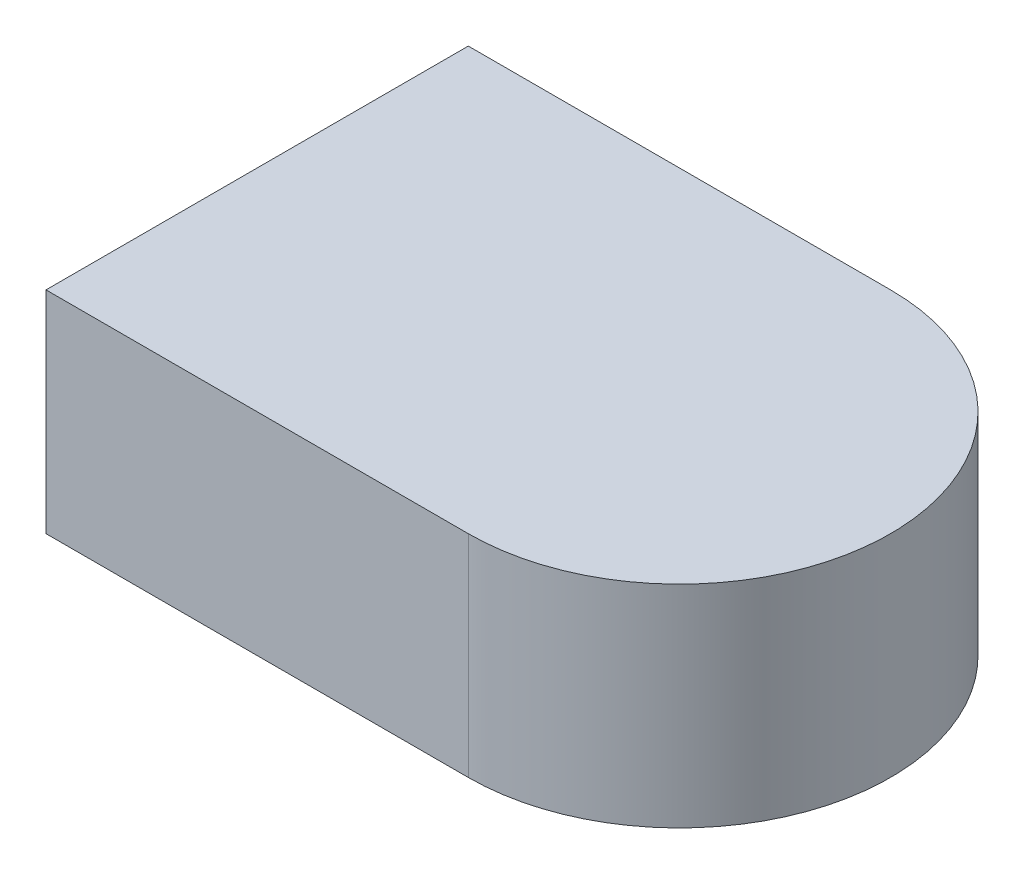
ISO-10303-21;
HEADER;
FILE_DESCRIPTION(('STEP AP214'),'2;1');
FILE_NAME('part.step','',(''),(''),'','','');
FILE_SCHEMA(('AUTOMOTIVE_DESIGN { 1 0 10303 214 1 1 1 1 }'));
ENDSEC;
DATA;
#1=APPLICATION_CONTEXT('core data for automotive mechanical design processes');
#2=APPLICATION_PROTOCOL_DEFINITION('international standard','automotive_design',2000,#1);
#3=PRODUCT_CONTEXT('',#1,'mechanical');
#4=PRODUCT('Part','Part','',(#3));
#5=PRODUCT_RELATED_PRODUCT_CATEGORY('part','',(#4));
#6=PRODUCT_DEFINITION_FORMATION('','',#4);
#7=PRODUCT_DEFINITION_CONTEXT('part definition',#1,'design');
#8=PRODUCT_DEFINITION('design','',#6,#7);
#9=PRODUCT_DEFINITION_SHAPE('','',#8);
#10=(LENGTH_UNIT() NAMED_UNIT(*) SI_UNIT(.MILLI.,.METRE.));
#11=(NAMED_UNIT(*) PLANE_ANGLE_UNIT() SI_UNIT($,.RADIAN.));
#12=(NAMED_UNIT(*) SI_UNIT($,.STERADIAN.) SOLID_ANGLE_UNIT());
#13=UNCERTAINTY_MEASURE_WITH_UNIT(LENGTH_MEASURE(1.E-05),#10,'distance_accuracy_value','');
#14=(GEOMETRIC_REPRESENTATION_CONTEXT(3) GLOBAL_UNCERTAINTY_ASSIGNED_CONTEXT((#13)) GLOBAL_UNIT_ASSIGNED_CONTEXT((#10,
#11,#12)) REPRESENTATION_CONTEXT('',''));
#15=CARTESIAN_POINT('',(0.,0.,0.));
#16=DIRECTION('',(0.,0.,1.));
#17=DIRECTION('',(1.,0.,0.));
#18=AXIS2_PLACEMENT_3D('',#15,#16,#17);
#19=CARTESIAN_POINT('',(0.,0.,0.));
#20=DIRECTION('',(0.,-1.,0.));
#21=DIRECTION('',(-1.,0.,0.));
#22=AXIS2_PLACEMENT_3D('',#19,#20,#21);
#23=PLANE('',#22);
#24=CARTESIAN_POINT('',(-1.05,0.,0.2));
#25=DIRECTION('',(0.,-1.,0.));
#26=DIRECTION('',(0.,0.,-1.));
#27=AXIS2_PLACEMENT_3D('',#24,#25,#26);
#28=CIRCLE('',#27,0.1);
#29=CARTESIAN_POINT('',(-1.05,0.,0.1));
#30=VERTEX_POINT('',#29);
#31=CARTESIAN_POINT('',(-1.05,0.,0.3));
#32=VERTEX_POINT('',#31);
#33=EDGE_CURVE('E11',#30,#32,#28,.T.);
#34=ORIENTED_EDGE('',*,*,#33,.T.);
#35=DIRECTION('',(-1.,0.,0.));
#36=VECTOR('',#35,1.);
#37=CARTESIAN_POINT('',(-1.05,0.,0.3));
#38=LINE('',#37,#36);
#39=CARTESIAN_POINT('',(-1.25,0.,0.3));
#40=VERTEX_POINT('',#39);
#41=EDGE_CURVE('E25',#32,#40,#38,.T.);
#42=ORIENTED_EDGE('',*,*,#41,.T.);
#43=DIRECTION('',(0.,0.,-1.));
#44=VECTOR('',#43,1.);
#45=CARTESIAN_POINT('',(-1.25,0.,0.3));
#46=LINE('',#45,#44);
#47=CARTESIAN_POINT('',(-1.25,0.,0.1));
#48=VERTEX_POINT('',#47);
#49=EDGE_CURVE('E73',#40,#48,#46,.T.);
#50=ORIENTED_EDGE('',*,*,#49,.T.);
#51=DIRECTION('',(1.,0.,0.));
#52=VECTOR('',#51,1.);
#53=CARTESIAN_POINT('',(-1.25,0.,0.1));
#54=LINE('',#53,#52);
#55=EDGE_CURVE('E99',#48,#30,#54,.T.);
#56=ORIENTED_EDGE('',*,*,#55,.T.);
#57=EDGE_LOOP('',(#34,#42,#50,#56));
#58=FACE_BOUND('',#57,.T.);
#59=ADVANCED_FACE('F17',(#58),#23,.T.);
#60=CARTESIAN_POINT('',(-1.25,0.,0.1));
#61=DIRECTION('',(0.,0.,1.));
#62=DIRECTION('',(1.,0.,0.));
#63=AXIS2_PLACEMENT_3D('',#60,#61,#62);
#64=PLANE('',#63);
#65=DIRECTION('',(0.,1.,0.));
#66=VECTOR('',#65,1.);
#67=CARTESIAN_POINT('',(-1.25,0.,0.1));
#68=LINE('',#67,#66);
#69=CARTESIAN_POINT('',(-1.25,0.1,0.1));
#70=VERTEX_POINT('',#69);
#71=EDGE_CURVE('E95',#48,#70,#68,.T.);
#72=ORIENTED_EDGE('',*,*,#71,.T.);
#73=DIRECTION('',(1.,0.,0.));
#74=VECTOR('',#73,1.);
#75=CARTESIAN_POINT('',(-1.25,0.1,0.1));
#76=LINE('',#75,#74);
#77=CARTESIAN_POINT('',(-1.05,0.1,0.1));
#78=VERTEX_POINT('',#77);
#79=EDGE_CURVE('E68',#70,#78,#76,.T.);
#80=ORIENTED_EDGE('',*,*,#79,.T.);
#81=DIRECTION('',(0.,1.,0.));
#82=VECTOR('',#81,1.);
#83=CARTESIAN_POINT('',(-1.05,0.,0.1));
#84=LINE('',#83,#82);
#85=EDGE_CURVE('E87',#30,#78,#84,.T.);
#86=ORIENTED_EDGE('',*,*,#85,.F.);
#87=ORIENTED_EDGE('',*,*,#55,.F.);
#88=EDGE_LOOP('',(#72,#80,#86,#87));
#89=FACE_BOUND('',#88,.T.);
#90=ADVANCED_FACE('F113',(#89),#64,.F.);
#91=CARTESIAN_POINT('',(-1.05,0.,0.2));
#92=DIRECTION('',(0.,-1.,0.));
#93=DIRECTION('',(-1.,0.,0.));
#94=AXIS2_PLACEMENT_3D('',#91,#92,#93);
#95=CYLINDRICAL_SURFACE('',#94,0.1);
#96=ORIENTED_EDGE('',*,*,#85,.T.);
#97=CARTESIAN_POINT('',(-1.05,0.1,0.2));
#98=DIRECTION('',(0.,-1.,0.));
#99=DIRECTION('',(0.,0.,-1.));
#100=AXIS2_PLACEMENT_3D('',#97,#98,#99);
#101=CIRCLE('',#100,0.1);
#102=CARTESIAN_POINT('',(-1.05,0.1,0.3));
#103=VERTEX_POINT('',#102);
#104=EDGE_CURVE('E83',#78,#103,#101,.T.);
#105=ORIENTED_EDGE('',*,*,#104,.T.);
#106=DIRECTION('',(0.,1.,0.));
#107=VECTOR('',#106,1.);
#108=CARTESIAN_POINT('',(-1.05,0.,0.3));
#109=LINE('',#108,#107);
#110=EDGE_CURVE('E60',#32,#103,#109,.T.);
#111=ORIENTED_EDGE('',*,*,#110,.F.);
#112=ORIENTED_EDGE('',*,*,#33,.F.);
#113=EDGE_LOOP('',(#96,#105,#111,#112));
#114=FACE_BOUND('',#113,.T.);
#115=ADVANCED_FACE('F115',(#114),#95,.T.);
#116=CARTESIAN_POINT('',(-1.05,0.,0.3));
#117=DIRECTION('',(0.,0.,-1.));
#118=DIRECTION('',(-1.,0.,0.));
#119=AXIS2_PLACEMENT_3D('',#116,#117,#118);
#120=PLANE('',#119);
#121=ORIENTED_EDGE('',*,*,#110,.T.);
#122=DIRECTION('',(-1.,0.,0.));
#123=VECTOR('',#122,1.);
#124=CARTESIAN_POINT('',(-1.05,0.1,0.3));
#125=LINE('',#124,#123);
#126=CARTESIAN_POINT('',(-1.25,0.1,0.3));
#127=VERTEX_POINT('',#126);
#128=EDGE_CURVE('E53',#103,#127,#125,.T.);
#129=ORIENTED_EDGE('',*,*,#128,.T.);
#130=DIRECTION('',(0.,1.,0.));
#131=VECTOR('',#130,1.);
#132=CARTESIAN_POINT('',(-1.25,0.,0.3));
#133=LINE('',#132,#131);
#134=EDGE_CURVE('E57',#40,#127,#133,.T.);
#135=ORIENTED_EDGE('',*,*,#134,.F.);
#136=ORIENTED_EDGE('',*,*,#41,.F.);
#137=EDGE_LOOP('',(#121,#129,#135,#136));
#138=FACE_BOUND('',#137,.T.);
#139=ADVANCED_FACE('F55',(#138),#120,.F.);
#140=CARTESIAN_POINT('',(-1.25,0.,0.3));
#141=DIRECTION('',(1.,0.,0.));
#142=DIRECTION('',(0.,0.,-1.));
#143=AXIS2_PLACEMENT_3D('',#140,#141,#142);
#144=PLANE('',#143);
#145=ORIENTED_EDGE('',*,*,#134,.T.);
#146=DIRECTION('',(0.,0.,-1.));
#147=VECTOR('',#146,1.);
#148=CARTESIAN_POINT('',(-1.25,0.1,0.3));
#149=LINE('',#148,#147);
#150=EDGE_CURVE('E66',#127,#70,#149,.T.);
#151=ORIENTED_EDGE('',*,*,#150,.T.);
#152=ORIENTED_EDGE('',*,*,#71,.F.);
#153=ORIENTED_EDGE('',*,*,#49,.F.);
#154=EDGE_LOOP('',(#145,#151,#152,#153));
#155=FACE_BOUND('',#154,.T.);
#156=ADVANCED_FACE('F72',(#155),#144,.F.);
#157=CARTESIAN_POINT('',(0.,0.1,0.));
#158=DIRECTION('',(0.,-1.,0.));
#159=DIRECTION('',(-1.,0.,0.));
#160=AXIS2_PLACEMENT_3D('',#157,#158,#159);
#161=PLANE('',#160);
#162=ORIENTED_EDGE('',*,*,#150,.F.);
#163=ORIENTED_EDGE('',*,*,#128,.F.);
#164=ORIENTED_EDGE('',*,*,#104,.F.);
#165=ORIENTED_EDGE('',*,*,#79,.F.);
#166=EDGE_LOOP('',(#162,#163,#164,#165));
#167=FACE_BOUND('',#166,.T.);
#168=ADVANCED_FACE('F67',(#167),#161,.F.);
#169=CLOSED_SHELL('',(#59,#90,#115,#139,#156,#168));
#170=MANIFOLD_SOLID_BREP('B1',#169);
#171=ADVANCED_BREP_SHAPE_REPRESENTATION('',(#18,#170),#14);
#172=SHAPE_DEFINITION_REPRESENTATION(#9,#171);
ENDSEC;
END-ISO-10303-21;
